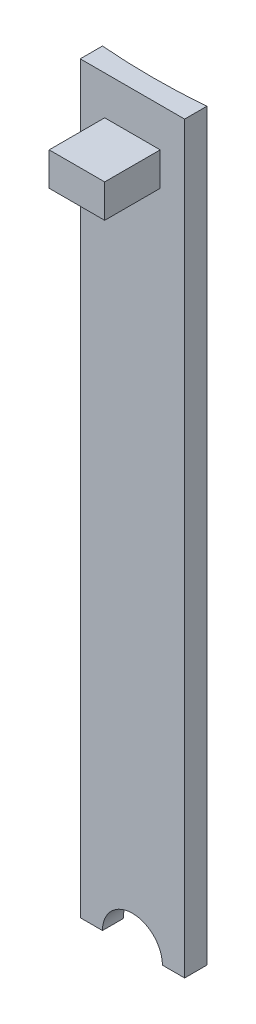
ISO-10303-21;
HEADER;
FILE_DESCRIPTION(('STEP AP214'),'2;1');
FILE_NAME('part.step','',(''),(''),'','','');
FILE_SCHEMA(('AUTOMOTIVE_DESIGN { 1 0 10303 214 1 1 1 1 }'));
ENDSEC;
DATA;
#1=APPLICATION_CONTEXT('core data for automotive mechanical design processes');
#2=APPLICATION_PROTOCOL_DEFINITION('international standard','automotive_design',2000,#1);
#3=PRODUCT_CONTEXT('',#1,'mechanical');
#4=PRODUCT('Part','Part','',(#3));
#5=PRODUCT_RELATED_PRODUCT_CATEGORY('part','',(#4));
#6=PRODUCT_DEFINITION_FORMATION('','',#4);
#7=PRODUCT_DEFINITION_CONTEXT('part definition',#1,'design');
#8=PRODUCT_DEFINITION('design','',#6,#7);
#9=PRODUCT_DEFINITION_SHAPE('','',#8);
#10=(LENGTH_UNIT() NAMED_UNIT(*) SI_UNIT(.MILLI.,.METRE.));
#11=(NAMED_UNIT(*) PLANE_ANGLE_UNIT() SI_UNIT($,.RADIAN.));
#12=(NAMED_UNIT(*) SI_UNIT($,.STERADIAN.) SOLID_ANGLE_UNIT());
#13=UNCERTAINTY_MEASURE_WITH_UNIT(LENGTH_MEASURE(1.E-05),#10,'distance_accuracy_value','');
#14=(GEOMETRIC_REPRESENTATION_CONTEXT(3) GLOBAL_UNCERTAINTY_ASSIGNED_CONTEXT((#13)) GLOBAL_UNIT_ASSIGNED_CONTEXT((#10,
#11,#12)) REPRESENTATION_CONTEXT('',''));
#15=CARTESIAN_POINT('',(0.,0.,0.));
#16=DIRECTION('',(0.,0.,1.));
#17=DIRECTION('',(1.,0.,0.));
#18=AXIS2_PLACEMENT_3D('',#15,#16,#17);
#19=CARTESIAN_POINT('',(0.,0.,1.));
#20=DIRECTION('',(0.,0.,1.));
#21=DIRECTION('',(1.,0.,0.));
#22=AXIS2_PLACEMENT_3D('',#19,#20,#21);
#23=PLANE('',#22);
#24=DIRECTION('',(-1.,0.,0.));
#25=VECTOR('',#24,1.);
#26=CARTESIAN_POINT('',(0.,-32.5000000000001,1.));
#27=LINE('',#26,#25);
#28=CARTESIAN_POINT('',(-2.69999999999999,-32.5000000000001,1.));
#29=VERTEX_POINT('',#28);
#30=CARTESIAN_POINT('',(-4.69999999999999,-32.5000000000001,1.));
#31=VERTEX_POINT('',#30);
#32=EDGE_CURVE('E158',#29,#31,#27,.T.);
#33=ORIENTED_EDGE('',*,*,#32,.F.);
#34=CARTESIAN_POINT('',(0.,-32.5000000000001,1.));
#35=DIRECTION('',(0.,0.,1.));
#36=DIRECTION('',(1.,0.,0.));
#37=AXIS2_PLACEMENT_3D('',#34,#35,#36);
#38=CIRCLE('',#37,2.7);
#39=CARTESIAN_POINT('',(2.70000000000001,-32.5000000000001,1.));
#40=VERTEX_POINT('',#39);
#41=EDGE_CURVE('E180',#29,#40,#38,.F.);
#42=ORIENTED_EDGE('',*,*,#41,.T.);
#43=DIRECTION('',(-1.,0.,0.));
#44=VECTOR('',#43,1.);
#45=CARTESIAN_POINT('',(0.,-32.5000000000001,1.));
#46=LINE('',#45,#44);
#47=CARTESIAN_POINT('',(4.70000000000001,-32.5000000000001,1.));
#48=VERTEX_POINT('',#47);
#49=EDGE_CURVE('E141',#48,#40,#46,.T.);
#50=ORIENTED_EDGE('',*,*,#49,.F.);
#51=DIRECTION('',(0.,-1.,0.));
#52=VECTOR('',#51,1.);
#53=CARTESIAN_POINT('',(4.7,0.,1.));
#54=LINE('',#53,#52);
#55=CARTESIAN_POINT('',(4.7,34.4999999999999,1.));
#56=VERTEX_POINT('',#55);
#57=EDGE_CURVE('E124',#56,#48,#54,.T.);
#58=ORIENTED_EDGE('',*,*,#57,.F.);
#59=DIRECTION('',(1.,0.,0.));
#60=VECTOR('',#59,1.);
#61=CARTESIAN_POINT('',(0.,34.4999999999999,1.));
#62=LINE('',#61,#60);
#63=CARTESIAN_POINT('',(-4.7,34.4999999999999,1.));
#64=VERTEX_POINT('',#63);
#65=EDGE_CURVE('E139',#64,#56,#62,.T.);
#66=ORIENTED_EDGE('',*,*,#65,.F.);
#67=DIRECTION('',(0.,1.,0.));
#68=VECTOR('',#67,1.);
#69=CARTESIAN_POINT('',(-4.7,0.,1.));
#70=LINE('',#69,#68);
#71=EDGE_CURVE('E147',#31,#64,#70,.T.);
#72=ORIENTED_EDGE('',*,*,#71,.F.);
#73=EDGE_LOOP('',(#33,#42,#50,#58,#66,#72));
#74=FACE_BOUND('',#73,.T.);
#75=DIRECTION('',(0.,-1.,0.));
#76=VECTOR('',#75,1.);
#77=CARTESIAN_POINT('',(2.5,30.9999999999999,1.));
#78=LINE('',#77,#76);
#79=CARTESIAN_POINT('',(2.5,30.9999999999999,1.));
#80=VERTEX_POINT('',#79);
#81=CARTESIAN_POINT('',(2.5,27.9999999999999,1.));
#82=VERTEX_POINT('',#81);
#83=EDGE_CURVE('E246',#80,#82,#78,.T.);
#84=ORIENTED_EDGE('',*,*,#83,.T.);
#85=DIRECTION('',(1.,0.,0.));
#86=VECTOR('',#85,1.);
#87=CARTESIAN_POINT('',(-2.5,27.9999999999999,1.));
#88=LINE('',#87,#86);
#89=CARTESIAN_POINT('',(-2.5,27.9999999999999,1.));
#90=VERTEX_POINT('',#89);
#91=EDGE_CURVE('E250',#90,#82,#88,.T.);
#92=ORIENTED_EDGE('',*,*,#91,.F.);
#93=DIRECTION('',(0.,-1.,0.));
#94=VECTOR('',#93,1.);
#95=CARTESIAN_POINT('',(-2.5,30.9999999999999,1.));
#96=LINE('',#95,#94);
#97=CARTESIAN_POINT('',(-2.5,30.9999999999999,1.));
#98=VERTEX_POINT('',#97);
#99=EDGE_CURVE('E239',#98,#90,#96,.T.);
#100=ORIENTED_EDGE('',*,*,#99,.F.);
#101=DIRECTION('',(1.,0.,0.));
#102=VECTOR('',#101,1.);
#103=CARTESIAN_POINT('',(-2.5,30.9999999999999,1.));
#104=LINE('',#103,#102);
#105=EDGE_CURVE('E75',#98,#80,#104,.T.);
#106=ORIENTED_EDGE('',*,*,#105,.T.);
#107=EDGE_LOOP('',(#84,#92,#100,#106));
#108=FACE_BOUND('',#107,.T.);
#109=ADVANCED_FACE('F59',(#74,#108),#23,.T.);
#110=CARTESIAN_POINT('',(0.,-32.5000000000001,1.));
#111=DIRECTION('',(0.,-1.,0.));
#112=DIRECTION('',(0.,0.,-1.));
#113=AXIS2_PLACEMENT_3D('',#110,#111,#112);
#114=PLANE('',#113);
#115=CARTESIAN_POINT('',(0.,-32.5000000000001,-57.8058975811491));
#116=DIRECTION('',(0.,1.,0.));
#117=DIRECTION('',(0.,0.,1.));
#118=AXIS2_PLACEMENT_3D('',#115,#116,#117);
#119=CIRCLE('',#118,57.);
#120=CARTESIAN_POINT('',(-4.69999999999999,-32.5000000000001,-1.));
#121=VERTEX_POINT('',#120);
#122=CARTESIAN_POINT('',(-2.69999999999999,-32.5000000000001,-0.869880860623229));
#123=VERTEX_POINT('',#122);
#124=EDGE_CURVE('E98',#121,#123,#119,.T.);
#125=ORIENTED_EDGE('',*,*,#124,.T.);
#126=DIRECTION('',(0.,0.,-1.));
#127=VECTOR('',#126,1.);
#128=CARTESIAN_POINT('',(-2.69999999999999,-32.5000000000001,1.));
#129=LINE('',#128,#127);
#130=EDGE_CURVE('E12',#29,#123,#129,.T.);
#131=ORIENTED_EDGE('',*,*,#130,.F.);
#132=ORIENTED_EDGE('',*,*,#32,.T.);
#133=DIRECTION('',(0.,0.,-1.));
#134=VECTOR('',#133,1.);
#135=CARTESIAN_POINT('',(-4.69999999999999,-32.5000000000001,1.));
#136=LINE('',#135,#134);
#137=EDGE_CURVE('E84',#31,#121,#136,.T.);
#138=ORIENTED_EDGE('',*,*,#137,.T.);
#139=EDGE_LOOP('',(#125,#131,#132,#138));
#140=FACE_BOUND('',#139,.T.);
#141=ADVANCED_FACE('F61',(#140),#114,.T.);
#142=CARTESIAN_POINT('',(0.,-32.5000000000001,1.));
#143=DIRECTION('',(0.,0.,-1.));
#144=DIRECTION('',(-1.,0.,0.));
#145=AXIS2_PLACEMENT_3D('',#142,#143,#144);
#146=CYLINDRICAL_SURFACE('',#145,2.7);
#147=ORIENTED_EDGE('',*,*,#130,.T.);
#148=CARTESIAN_POINT('',(-2.69999999999999,-32.5000000000001,-0.869880860623229));
#149=CARTESIAN_POINT('',(-2.70000732456482,-32.4241053607509,-0.869882339341284));
#150=CARTESIAN_POINT('',(-2.69680003165618,-32.3482142297595,-0.869729142345486));
#151=CARTESIAN_POINT('',(-2.68401290431147,-32.1969757558752,-0.869124316677932));
#152=CARTESIAN_POINT('',(-2.67443340141628,-32.1216283848969,-0.868672703532532));
#153=CARTESIAN_POINT('',(-2.64896807420141,-31.9720622127172,-0.867482409008976));
#154=CARTESIAN_POINT('',(-2.63308697736561,-31.8978426086998,-0.866743942837965));
#155=CARTESIAN_POINT('',(-2.59514795867035,-31.7510247355525,-0.865002222914743));
#156=CARTESIAN_POINT('',(-2.57309010643287,-31.6784264481578,-0.863998972147089));
#157=CARTESIAN_POINT('',(-2.49783261171168,-31.463768816912,-0.86063091398507));
#158=CARTESIAN_POINT('',(-2.43553766536324,-31.3247803123233,-0.857907235652962));
#159=CARTESIAN_POINT('',(-2.2885658446912,-31.0593362776797,-0.851812236909451));
#160=CARTESIAN_POINT('',(-2.20389298514474,-30.9328785051007,-0.848441032698996));
#161=CARTESIAN_POINT('',(-2.01446568164372,-30.6958531654643,-0.841427135152574));
#162=CARTESIAN_POINT('',(-1.90969680358119,-30.585297120421,-0.83778424783476));
#163=CARTESIAN_POINT('',(-1.68307252986893,-30.3833248870339,-0.830638976865392));
#164=CARTESIAN_POINT('',(-1.56121453587472,-30.2919116145661,-0.827136614684572));
#165=CARTESIAN_POINT('',(-1.30381602729783,-30.1307966234203,-0.82066598920255));
#166=CARTESIAN_POINT('',(-1.16826969014489,-30.0611041960177,-0.817697954693193));
#167=CARTESIAN_POINT('',(-0.887392459809831,-29.9454748197964,-0.81263269194504));
#168=CARTESIAN_POINT('',(-0.742062238288387,-29.8995362421588,-0.810535404000459));
#169=CARTESIAN_POINT('',(-0.445848752406314,-29.8327443755039,-0.807449103913015));
#170=CARTESIAN_POINT('',(-0.294969673309991,-29.8118725640138,-0.806459273478597));
#171=CARTESIAN_POINT('',(0.0081573542541016,-29.7957496030039,-0.805696684593874));
#172=CARTESIAN_POINT('',(0.160405326592097,-29.8004989011234,-0.805923947408016));
#173=CARTESIAN_POINT('',(0.461814500668182,-29.8354688001901,-0.807569286789664));
#174=CARTESIAN_POINT('',(0.610978109864713,-29.8656687028844,-0.808986395685742));
#175=CARTESIAN_POINT('',(0.902115506682112,-29.9506503937841,-0.812850666304796));
#176=CARTESIAN_POINT('',(1.04408929808984,-30.0054321690421,-0.81529782748524));
#177=CARTESIAN_POINT('',(1.31688707696982,-30.1380474139353,-0.820948243884149));
#178=CARTESIAN_POINT('',(1.44770623310544,-30.2158908074458,-0.824151824484286));
#179=CARTESIAN_POINT('',(1.69442141309884,-30.3924086272794,-0.830954048103913));
#180=CARTESIAN_POINT('',(1.81031805738849,-30.4910821870981,-0.83455267468708));
#181=CARTESIAN_POINT('',(2.02401064082768,-30.7065601950441,-0.841743526625007));
#182=CARTESIAN_POINT('',(2.12179112848464,-30.8233799656187,-0.845335743950919));
#183=CARTESIAN_POINT('',(2.29638597382443,-31.0718316211869,-0.852106893692294));
#184=CARTESIAN_POINT('',(2.37319372789438,-31.2034681531014,-0.855285695772498));
#185=CARTESIAN_POINT('',(2.50365780431374,-31.4778427421657,-0.860871625750809));
#186=CARTESIAN_POINT('',(2.55729944465184,-31.6205877721326,-0.863278264026263));
#187=CARTESIAN_POINT('',(2.63976917285676,-31.9129614235305,-0.867041328376582));
#188=CARTESIAN_POINT('',(2.66863507324411,-32.0625791868277,-0.868399354515135));
#189=CARTESIAN_POINT('',(2.68983082504101,-32.2610025213748,-0.869399463231084));
#190=CARTESIAN_POINT('',(2.6936462557648,-32.3087642925624,-0.869579890839731));
#191=CARTESIAN_POINT('',(2.69872736855736,-32.4043442199358,-0.869820430977037));
#192=CARTESIAN_POINT('',(2.69999726823685,-32.4521621512877,-0.869880742521174));
#193=CARTESIAN_POINT('',(2.70000000000001,-32.5,-0.869880860623228));
#194=B_SPLINE_CURVE_WITH_KNOTS('',3,(#148,#149,#150,#151,#152,#153,#154,#155,#156,#157,#158,
#159,#160,#161,#162,#163,#164,#165,#166,#167,#168,#169,#170,#171,#172,#173,#174,#175,#176,#177,
#178,#179,#180,#181,#182,#183,#184,#185,#186,#187,#188,#189,#190,#191,#192,#193),.UNSPECIFIED.,
.F.,.F.,(4,2,2,2,2,2,2,2,2,2,2,2,2,2,2,2,2,2,2,2,2,2,4),(0.,0.227609703753393,0.455207566086378,
0.682635005331029,0.910059881204889,1.36471009872762,1.81927880366062,2.27417523673384,
2.72914091047107,3.18430093336528,3.63942974146323,4.09422203595259,4.54902227637293,
5.0034529972393,5.45788347875556,5.91250979553774,6.36711720425654,6.82211058598254,
7.2772470651506,7.73267157482233,8.18739977728914,8.33109489116103,8.47455172364968),.UNSPECIFIED.);
#195=CARTESIAN_POINT('',(2.70000000000001,-32.5000000000001,-0.869880860623229));
#196=VERTEX_POINT('',#195);
#197=EDGE_CURVE('E155',#123,#196,#194,.T.);
#198=ORIENTED_EDGE('',*,*,#197,.T.);
#199=DIRECTION('',(0.,0.,-1.));
#200=VECTOR('',#199,1.);
#201=CARTESIAN_POINT('',(2.70000000000001,-32.5000000000001,1.));
#202=LINE('',#201,#200);
#203=EDGE_CURVE('E68',#40,#196,#202,.T.);
#204=ORIENTED_EDGE('',*,*,#203,.F.);
#205=ORIENTED_EDGE('',*,*,#41,.F.);
#206=EDGE_LOOP('',(#147,#198,#204,#205));
#207=FACE_BOUND('',#206,.T.);
#208=ADVANCED_FACE('F179',(#207),#146,.F.);
#209=CARTESIAN_POINT('',(0.,-32.5000000000001,1.));
#210=DIRECTION('',(0.,-1.,0.));
#211=DIRECTION('',(0.,0.,-1.));
#212=AXIS2_PLACEMENT_3D('',#209,#210,#211);
#213=PLANE('',#212);
#214=CARTESIAN_POINT('',(4.70000000000002,-32.5000000000001,-1.));
#215=VERTEX_POINT('',#214);
#216=EDGE_CURVE('E173',#196,#215,#119,.T.);
#217=ORIENTED_EDGE('',*,*,#216,.T.);
#218=DIRECTION('',(0.,0.,-1.));
#219=VECTOR('',#218,1.);
#220=CARTESIAN_POINT('',(4.70000000000001,-32.5000000000001,1.));
#221=LINE('',#220,#219);
#222=EDGE_CURVE('E130',#48,#215,#221,.T.);
#223=ORIENTED_EDGE('',*,*,#222,.F.);
#224=ORIENTED_EDGE('',*,*,#49,.T.);
#225=ORIENTED_EDGE('',*,*,#203,.T.);
#226=EDGE_LOOP('',(#217,#223,#224,#225));
#227=FACE_BOUND('',#226,.T.);
#228=ADVANCED_FACE('F170',(#227),#213,.T.);
#229=CARTESIAN_POINT('',(4.7,0.,1.));
#230=DIRECTION('',(1.,0.,0.));
#231=DIRECTION('',(0.,1.,0.));
#232=AXIS2_PLACEMENT_3D('',#229,#230,#231);
#233=PLANE('',#232);
#234=DIRECTION('',(0.,-1.,0.));
#235=VECTOR('',#234,1.);
#236=CARTESIAN_POINT('',(4.7,0.,-1.));
#237=LINE('',#236,#235);
#238=CARTESIAN_POINT('',(4.70000000000002,34.4999999999999,-1.));
#239=VERTEX_POINT('',#238);
#240=EDGE_CURVE('E126',#239,#215,#237,.T.);
#241=ORIENTED_EDGE('',*,*,#240,.F.);
#242=DIRECTION('',(0.,0.,-1.));
#243=VECTOR('',#242,1.);
#244=CARTESIAN_POINT('',(4.7,34.4999999999999,1.));
#245=LINE('',#244,#243);
#246=EDGE_CURVE('E120',#56,#239,#245,.T.);
#247=ORIENTED_EDGE('',*,*,#246,.F.);
#248=ORIENTED_EDGE('',*,*,#57,.T.);
#249=ORIENTED_EDGE('',*,*,#222,.T.);
#250=EDGE_LOOP('',(#241,#247,#248,#249));
#251=FACE_BOUND('',#250,.T.);
#252=ADVANCED_FACE('F122',(#251),#233,.T.);
#253=CARTESIAN_POINT('',(0.,34.4999999999999,1.));
#254=DIRECTION('',(0.,1.,0.));
#255=DIRECTION('',(0.,0.,1.));
#256=AXIS2_PLACEMENT_3D('',#253,#254,#255);
#257=PLANE('',#256);
#258=CARTESIAN_POINT('',(0.,34.4999999999999,-57.8058975811491));
#259=DIRECTION('',(0.,1.,0.));
#260=DIRECTION('',(0.,0.,1.));
#261=AXIS2_PLACEMENT_3D('',#258,#259,#260);
#262=CIRCLE('',#261,57.);
#263=CARTESIAN_POINT('',(-4.70000000000002,34.4999999999999,-1.));
#264=VERTEX_POINT('',#263);
#265=EDGE_CURVE('E221',#264,#239,#262,.T.);
#266=ORIENTED_EDGE('',*,*,#265,.F.);
#267=DIRECTION('',(0.,0.,-1.));
#268=VECTOR('',#267,1.);
#269=CARTESIAN_POINT('',(-4.7,34.4999999999999,1.));
#270=LINE('',#269,#268);
#271=EDGE_CURVE('E131',#64,#264,#270,.T.);
#272=ORIENTED_EDGE('',*,*,#271,.F.);
#273=ORIENTED_EDGE('',*,*,#65,.T.);
#274=ORIENTED_EDGE('',*,*,#246,.T.);
#275=EDGE_LOOP('',(#266,#272,#273,#274));
#276=FACE_BOUND('',#275,.T.);
#277=ADVANCED_FACE('F144',(#276),#257,.T.);
#278=CARTESIAN_POINT('',(-4.7,0.,1.));
#279=DIRECTION('',(-1.,0.,0.));
#280=DIRECTION('',(0.,-1.,0.));
#281=AXIS2_PLACEMENT_3D('',#278,#279,#280);
#282=PLANE('',#281);
#283=DIRECTION('',(0.,1.,0.));
#284=VECTOR('',#283,1.);
#285=CARTESIAN_POINT('',(-4.7,0.,-1.));
#286=LINE('',#285,#284);
#287=EDGE_CURVE('E105',#121,#264,#286,.T.);
#288=ORIENTED_EDGE('',*,*,#287,.F.);
#289=ORIENTED_EDGE('',*,*,#137,.F.);
#290=ORIENTED_EDGE('',*,*,#71,.T.);
#291=ORIENTED_EDGE('',*,*,#271,.T.);
#292=EDGE_LOOP('',(#288,#289,#290,#291));
#293=FACE_BOUND('',#292,.T.);
#294=ADVANCED_FACE('F201',(#293),#282,.T.);
#295=CARTESIAN_POINT('',(0.,-32.5000000000001,-57.8058975811491));
#296=DIRECTION('',(0.,1.,0.));
#297=DIRECTION('',(0.,0.,1.));
#298=AXIS2_PLACEMENT_3D('',#295,#296,#297);
#299=CYLINDRICAL_SURFACE('',#298,57.);
#300=ORIENTED_EDGE('',*,*,#124,.F.);
#301=ORIENTED_EDGE('',*,*,#287,.T.);
#302=ORIENTED_EDGE('',*,*,#265,.T.);
#303=ORIENTED_EDGE('',*,*,#240,.T.);
#304=ORIENTED_EDGE('',*,*,#216,.F.);
#305=ORIENTED_EDGE('',*,*,#197,.F.);
#306=EDGE_LOOP('',(#300,#301,#302,#303,#304,#305));
#307=FACE_BOUND('',#306,.T.);
#308=ADVANCED_FACE('F195',(#307),#299,.F.);
#309=CARTESIAN_POINT('',(-2.5,27.9999999999999,6.));
#310=DIRECTION('',(0.,1.,0.));
#311=DIRECTION('',(0.,0.,1.));
#312=AXIS2_PLACEMENT_3D('',#309,#310,#311);
#313=PLANE('',#312);
#314=ORIENTED_EDGE('',*,*,#91,.T.);
#315=DIRECTION('',(0.,0.,-1.));
#316=VECTOR('',#315,1.);
#317=CARTESIAN_POINT('',(2.5,27.9999999999999,6.));
#318=LINE('',#317,#316);
#319=CARTESIAN_POINT('',(2.5,27.9999999999999,6.));
#320=VERTEX_POINT('',#319);
#321=EDGE_CURVE('E223',#320,#82,#318,.T.);
#322=ORIENTED_EDGE('',*,*,#321,.F.);
#323=DIRECTION('',(1.,0.,0.));
#324=VECTOR('',#323,1.);
#325=CARTESIAN_POINT('',(-2.5,27.9999999999999,6.));
#326=LINE('',#325,#324);
#327=CARTESIAN_POINT('',(-2.5,27.9999999999999,6.));
#328=VERTEX_POINT('',#327);
#329=EDGE_CURVE('E243',#328,#320,#326,.T.);
#330=ORIENTED_EDGE('',*,*,#329,.F.);
#331=DIRECTION('',(0.,0.,-1.));
#332=VECTOR('',#331,1.);
#333=CARTESIAN_POINT('',(-2.5,27.9999999999999,6.));
#334=LINE('',#333,#332);
#335=EDGE_CURVE('E234',#328,#90,#334,.T.);
#336=ORIENTED_EDGE('',*,*,#335,.T.);
#337=EDGE_LOOP('',(#314,#322,#330,#336));
#338=FACE_BOUND('',#337,.T.);
#339=ADVANCED_FACE('F200',(#338),#313,.F.);
#340=CARTESIAN_POINT('',(2.5,30.9999999999999,6.));
#341=DIRECTION('',(1.,0.,0.));
#342=DIRECTION('',(0.,1.,0.));
#343=AXIS2_PLACEMENT_3D('',#340,#341,#342);
#344=PLANE('',#343);
#345=ORIENTED_EDGE('',*,*,#83,.F.);
#346=DIRECTION('',(0.,0.,-1.));
#347=VECTOR('',#346,1.);
#348=CARTESIAN_POINT('',(2.5,30.9999999999999,6.));
#349=LINE('',#348,#347);
#350=CARTESIAN_POINT('',(2.5,30.9999999999999,6.));
#351=VERTEX_POINT('',#350);
#352=EDGE_CURVE('E226',#351,#80,#349,.T.);
#353=ORIENTED_EDGE('',*,*,#352,.F.);
#354=DIRECTION('',(0.,-1.,0.));
#355=VECTOR('',#354,1.);
#356=CARTESIAN_POINT('',(2.5,30.9999999999999,6.));
#357=LINE('',#356,#355);
#358=EDGE_CURVE('E261',#351,#320,#357,.T.);
#359=ORIENTED_EDGE('',*,*,#358,.T.);
#360=ORIENTED_EDGE('',*,*,#321,.T.);
#361=EDGE_LOOP('',(#345,#353,#359,#360));
#362=FACE_BOUND('',#361,.T.);
#363=ADVANCED_FACE('F285',(#362),#344,.T.);
#364=CARTESIAN_POINT('',(-2.5,30.9999999999999,6.));
#365=DIRECTION('',(0.,1.,0.));
#366=DIRECTION('',(0.,0.,1.));
#367=AXIS2_PLACEMENT_3D('',#364,#365,#366);
#368=PLANE('',#367);
#369=ORIENTED_EDGE('',*,*,#105,.F.);
#370=DIRECTION('',(0.,0.,-1.));
#371=VECTOR('',#370,1.);
#372=CARTESIAN_POINT('',(-2.5,30.9999999999999,6.));
#373=LINE('',#372,#371);
#374=CARTESIAN_POINT('',(-2.5,30.9999999999999,6.));
#375=VERTEX_POINT('',#374);
#376=EDGE_CURVE('E231',#375,#98,#373,.T.);
#377=ORIENTED_EDGE('',*,*,#376,.F.);
#378=DIRECTION('',(1.,0.,0.));
#379=VECTOR('',#378,1.);
#380=CARTESIAN_POINT('',(-2.5,30.9999999999999,6.));
#381=LINE('',#380,#379);
#382=EDGE_CURVE('E257',#375,#351,#381,.T.);
#383=ORIENTED_EDGE('',*,*,#382,.T.);
#384=ORIENTED_EDGE('',*,*,#352,.T.);
#385=EDGE_LOOP('',(#369,#377,#383,#384));
#386=FACE_BOUND('',#385,.T.);
#387=ADVANCED_FACE('F289',(#386),#368,.T.);
#388=CARTESIAN_POINT('',(-2.5,30.9999999999999,6.));
#389=DIRECTION('',(1.,0.,0.));
#390=DIRECTION('',(0.,0.,-1.));
#391=AXIS2_PLACEMENT_3D('',#388,#389,#390);
#392=PLANE('',#391);
#393=ORIENTED_EDGE('',*,*,#99,.T.);
#394=ORIENTED_EDGE('',*,*,#335,.F.);
#395=DIRECTION('',(0.,-1.,0.));
#396=VECTOR('',#395,1.);
#397=CARTESIAN_POINT('',(-2.5,30.9999999999999,6.));
#398=LINE('',#397,#396);
#399=EDGE_CURVE('E238',#375,#328,#398,.T.);
#400=ORIENTED_EDGE('',*,*,#399,.F.);
#401=ORIENTED_EDGE('',*,*,#376,.T.);
#402=EDGE_LOOP('',(#393,#394,#400,#401));
#403=FACE_BOUND('',#402,.T.);
#404=ADVANCED_FACE('F298',(#403),#392,.F.);
#405=CARTESIAN_POINT('',(0.,0.,6.));
#406=DIRECTION('',(0.,0.,-1.));
#407=DIRECTION('',(-1.,0.,0.));
#408=AXIS2_PLACEMENT_3D('',#405,#406,#407);
#409=PLANE('',#408);
#410=ORIENTED_EDGE('',*,*,#329,.T.);
#411=ORIENTED_EDGE('',*,*,#358,.F.);
#412=ORIENTED_EDGE('',*,*,#382,.F.);
#413=ORIENTED_EDGE('',*,*,#399,.T.);
#414=EDGE_LOOP('',(#410,#411,#412,#413));
#415=FACE_BOUND('',#414,.T.);
#416=ADVANCED_FACE('F272',(#415),#409,.F.);
#417=CLOSED_SHELL('',(#109,#141,#208,#228,#252,#277,#294,#308,#339,#363,#387,#404,#416));
#418=MANIFOLD_SOLID_BREP('B2',#417);
#419=ADVANCED_BREP_SHAPE_REPRESENTATION('',(#18,#418),#14);
#420=SHAPE_DEFINITION_REPRESENTATION(#9,#419);
ENDSEC;
END-ISO-10303-21;
